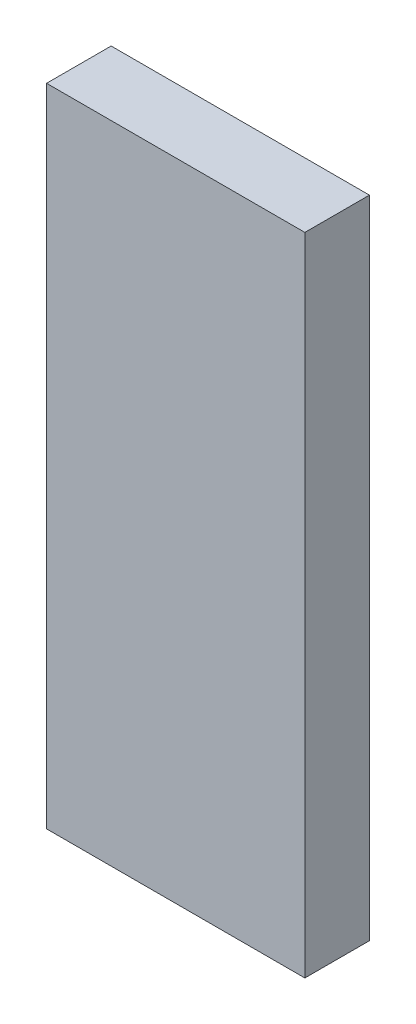
ISO-10303-21;
HEADER;
FILE_DESCRIPTION(('STEP AP214'),'2;1');
FILE_NAME('part.step','',(''),(''),'','','');
FILE_SCHEMA(('AUTOMOTIVE_DESIGN { 1 0 10303 214 1 1 1 1 }'));
ENDSEC;
DATA;
#1=APPLICATION_CONTEXT('core data for automotive mechanical design processes');
#2=APPLICATION_PROTOCOL_DEFINITION('international standard','automotive_design',2000,#1);
#3=PRODUCT_CONTEXT('',#1,'mechanical');
#4=PRODUCT('Part','Part','',(#3));
#5=PRODUCT_RELATED_PRODUCT_CATEGORY('part','',(#4));
#6=PRODUCT_DEFINITION_FORMATION('','',#4);
#7=PRODUCT_DEFINITION_CONTEXT('part definition',#1,'design');
#8=PRODUCT_DEFINITION('design','',#6,#7);
#9=PRODUCT_DEFINITION_SHAPE('','',#8);
#10=(LENGTH_UNIT() NAMED_UNIT(*) SI_UNIT(.MILLI.,.METRE.));
#11=(NAMED_UNIT(*) PLANE_ANGLE_UNIT() SI_UNIT($,.RADIAN.));
#12=(NAMED_UNIT(*) SI_UNIT($,.STERADIAN.) SOLID_ANGLE_UNIT());
#13=UNCERTAINTY_MEASURE_WITH_UNIT(LENGTH_MEASURE(1.E-05),#10,'distance_accuracy_value','');
#14=(GEOMETRIC_REPRESENTATION_CONTEXT(3) GLOBAL_UNCERTAINTY_ASSIGNED_CONTEXT((#13)) GLOBAL_UNIT_ASSIGNED_CONTEXT((#10,
#11,#12)) REPRESENTATION_CONTEXT('',''));
#15=CARTESIAN_POINT('',(0.,0.,0.));
#16=DIRECTION('',(0.,0.,1.));
#17=DIRECTION('',(1.,0.,0.));
#18=AXIS2_PLACEMENT_3D('',#15,#16,#17);
#19=CARTESIAN_POINT('',(1.585000001916,0.750000000915,4.124263960052));
#20=DIRECTION('',(0.,0.,-1.));
#21=DIRECTION('',(-1.,0.,0.));
#22=AXIS2_PLACEMENT_3D('',#19,#20,#21);
#23=PLANE('',#22);
#24=DIRECTION('',(0.,1.,0.));
#25=VECTOR('',#24,1.);
#26=CARTESIAN_POINT('',(1.585000001916,-0.750000000187,4.124263960052));
#27=LINE('',#26,#25);
#28=CARTESIAN_POINT('',(1.585000001916,-0.750000000187,4.124263960052));
#29=VERTEX_POINT('',#28);
#30=CARTESIAN_POINT('',(1.585000001916,0.750000000915,4.124263960052));
#31=VERTEX_POINT('',#30);
#32=EDGE_CURVE('E58',#29,#31,#27,.T.);
#33=ORIENTED_EDGE('',*,*,#32,.T.);
#34=DIRECTION('',(1.,0.,0.));
#35=VECTOR('',#34,1.);
#36=CARTESIAN_POINT('',(1.585000001916,0.750000000915,4.124263960052));
#37=LINE('',#36,#35);
#38=CARTESIAN_POINT('',(2.185000001916,0.750000000915,4.124263960052));
#39=VERTEX_POINT('',#38);
#40=EDGE_CURVE('E55',#31,#39,#37,.T.);
#41=ORIENTED_EDGE('',*,*,#40,.T.);
#42=DIRECTION('',(0.,1.,0.));
#43=VECTOR('',#42,1.);
#44=CARTESIAN_POINT('',(2.185000001916,0.750000000915,4.124263960052));
#45=LINE('',#44,#43);
#46=CARTESIAN_POINT('',(2.185000001916,-0.750000000187,4.124263960052));
#47=VERTEX_POINT('',#46);
#48=EDGE_CURVE('E77',#39,#47,#45,.F.);
#49=ORIENTED_EDGE('',*,*,#48,.T.);
#50=DIRECTION('',(-1.,0.,0.));
#51=VECTOR('',#50,1.);
#52=CARTESIAN_POINT('',(1.585000001916,-0.750000000187,4.124263960052));
#53=LINE('',#52,#51);
#54=EDGE_CURVE('E20',#47,#29,#53,.T.);
#55=ORIENTED_EDGE('',*,*,#54,.T.);
#56=EDGE_LOOP('',(#33,#41,#49,#55));
#57=FACE_BOUND('',#56,.T.);
#58=ADVANCED_FACE('F17',(#57),#23,.T.);
#59=CARTESIAN_POINT('',(1.585000001916,-0.750000000187,4.124263960052));
#60=DIRECTION('',(1.,0.,0.));
#61=DIRECTION('',(0.,0.,-1.));
#62=AXIS2_PLACEMENT_3D('',#59,#60,#61);
#63=PLANE('',#62);
#64=ORIENTED_EDGE('',*,*,#32,.F.);
#65=DIRECTION('',(0.,0.,1.));
#66=VECTOR('',#65,1.);
#67=CARTESIAN_POINT('',(1.585000001916,-0.750000000187,4.124263960052));
#68=LINE('',#67,#66);
#69=CARTESIAN_POINT('',(1.585000001916,-0.750000000187,4.274263960052));
#70=VERTEX_POINT('',#69);
#71=EDGE_CURVE('E80',#29,#70,#68,.T.);
#72=ORIENTED_EDGE('',*,*,#71,.T.);
#73=DIRECTION('',(0.,1.,0.));
#74=VECTOR('',#73,1.);
#75=CARTESIAN_POINT('',(1.585000001916,0.750000000915,4.274263960052));
#76=LINE('',#75,#74);
#77=CARTESIAN_POINT('',(1.585000001916,0.750000000915,4.274263960052));
#78=VERTEX_POINT('',#77);
#79=EDGE_CURVE('E73',#70,#78,#76,.T.);
#80=ORIENTED_EDGE('',*,*,#79,.T.);
#81=DIRECTION('',(0.,0.,-1.));
#82=VECTOR('',#81,1.);
#83=CARTESIAN_POINT('',(1.585000001916,0.750000000915,4.124263960052));
#84=LINE('',#83,#82);
#85=EDGE_CURVE('E63',#78,#31,#84,.T.);
#86=ORIENTED_EDGE('',*,*,#85,.T.);
#87=EDGE_LOOP('',(#64,#72,#80,#86));
#88=FACE_BOUND('',#87,.T.);
#89=ADVANCED_FACE('F72',(#88),#63,.F.);
#90=CARTESIAN_POINT('',(1.585000001916,0.750000000915,4.124263960052));
#91=DIRECTION('',(0.,-1.,0.));
#92=DIRECTION('',(0.,0.,-1.));
#93=AXIS2_PLACEMENT_3D('',#90,#91,#92);
#94=PLANE('',#93);
#95=ORIENTED_EDGE('',*,*,#40,.F.);
#96=ORIENTED_EDGE('',*,*,#85,.F.);
#97=DIRECTION('',(-1.,0.,0.));
#98=VECTOR('',#97,1.);
#99=CARTESIAN_POINT('',(1.585000001916,0.750000000915,4.274263960052));
#100=LINE('',#99,#98);
#101=CARTESIAN_POINT('',(2.185000001916,0.750000000915,4.274263960052));
#102=VERTEX_POINT('',#101);
#103=EDGE_CURVE('E83',#78,#102,#100,.F.);
#104=ORIENTED_EDGE('',*,*,#103,.T.);
#105=DIRECTION('',(0.,0.,1.));
#106=VECTOR('',#105,1.);
#107=CARTESIAN_POINT('',(2.185000001916,0.750000000915,4.124263960052));
#108=LINE('',#107,#106);
#109=EDGE_CURVE('E69',#102,#39,#108,.F.);
#110=ORIENTED_EDGE('',*,*,#109,.T.);
#111=EDGE_LOOP('',(#95,#96,#104,#110));
#112=FACE_BOUND('',#111,.T.);
#113=ADVANCED_FACE('F66',(#112),#94,.F.);
#114=CARTESIAN_POINT('',(2.185000001916,0.750000000915,4.124263960052));
#115=DIRECTION('',(-1.,0.,0.));
#116=DIRECTION('',(0.,0.,1.));
#117=AXIS2_PLACEMENT_3D('',#114,#115,#116);
#118=PLANE('',#117);
#119=ORIENTED_EDGE('',*,*,#48,.F.);
#120=ORIENTED_EDGE('',*,*,#109,.F.);
#121=DIRECTION('',(0.,1.,0.));
#122=VECTOR('',#121,1.);
#123=CARTESIAN_POINT('',(2.185000001916,0.750000000915,4.274263960052));
#124=LINE('',#123,#122);
#125=CARTESIAN_POINT('',(2.185000001916,-0.750000000187,4.274263960052));
#126=VERTEX_POINT('',#125);
#127=EDGE_CURVE('E26',#102,#126,#124,.F.);
#128=ORIENTED_EDGE('',*,*,#127,.T.);
#129=DIRECTION('',(0.,0.,1.));
#130=VECTOR('',#129,1.);
#131=CARTESIAN_POINT('',(2.185000001916,-0.750000000187,4.124263960052));
#132=LINE('',#131,#130);
#133=EDGE_CURVE('E34',#126,#47,#132,.F.);
#134=ORIENTED_EDGE('',*,*,#133,.T.);
#135=EDGE_LOOP('',(#119,#120,#128,#134));
#136=FACE_BOUND('',#135,.T.);
#137=ADVANCED_FACE('F88',(#136),#118,.F.);
#138=CARTESIAN_POINT('',(2.185000001916,-0.750000000187,4.124263960052));
#139=DIRECTION('',(0.,1.,0.));
#140=DIRECTION('',(0.,0.,1.));
#141=AXIS2_PLACEMENT_3D('',#138,#139,#140);
#142=PLANE('',#141);
#143=ORIENTED_EDGE('',*,*,#54,.F.);
#144=ORIENTED_EDGE('',*,*,#133,.F.);
#145=DIRECTION('',(-1.,0.,0.));
#146=VECTOR('',#145,1.);
#147=CARTESIAN_POINT('',(1.585000001916,-0.750000000187,4.274263960052));
#148=LINE('',#147,#146);
#149=EDGE_CURVE('E11',#126,#70,#148,.T.);
#150=ORIENTED_EDGE('',*,*,#149,.T.);
#151=ORIENTED_EDGE('',*,*,#71,.F.);
#152=EDGE_LOOP('',(#143,#144,#150,#151));
#153=FACE_BOUND('',#152,.T.);
#154=ADVANCED_FACE('F91',(#153),#142,.F.);
#155=CARTESIAN_POINT('',(1.585000001916,0.750000000915,4.274263960052));
#156=DIRECTION('',(0.,0.,-1.));
#157=DIRECTION('',(-1.,0.,0.));
#158=AXIS2_PLACEMENT_3D('',#155,#156,#157);
#159=PLANE('',#158);
#160=ORIENTED_EDGE('',*,*,#127,.F.);
#161=ORIENTED_EDGE('',*,*,#103,.F.);
#162=ORIENTED_EDGE('',*,*,#79,.F.);
#163=ORIENTED_EDGE('',*,*,#149,.F.);
#164=EDGE_LOOP('',(#160,#161,#162,#163));
#165=FACE_BOUND('',#164,.T.);
#166=ADVANCED_FACE('F90',(#165),#159,.F.);
#167=CLOSED_SHELL('',(#58,#89,#113,#137,#154,#166));
#168=MANIFOLD_SOLID_BREP('B1',#167);
#169=ADVANCED_BREP_SHAPE_REPRESENTATION('',(#18,#168),#14);
#170=SHAPE_DEFINITION_REPRESENTATION(#9,#169);
ENDSEC;
END-ISO-10303-21;
